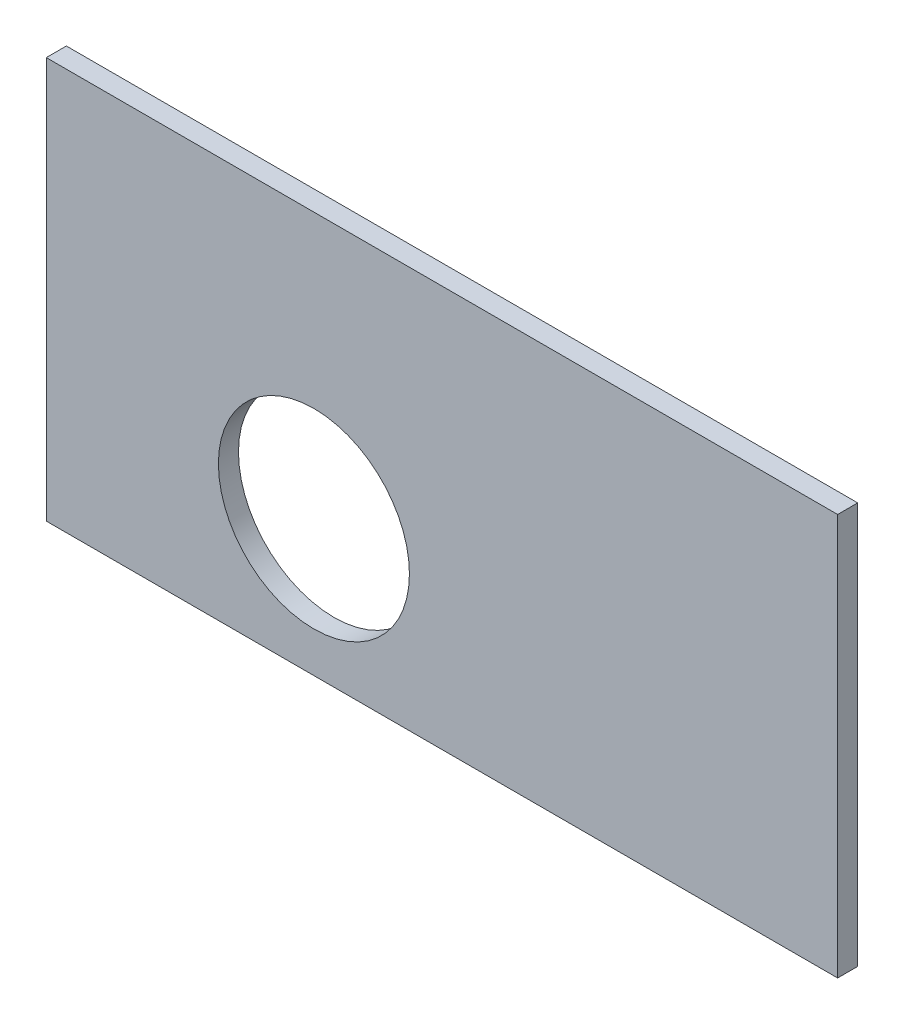
ISO-10303-21;
HEADER;
FILE_DESCRIPTION(('STEP AP214'),'2;1');
FILE_NAME('part.step','',(''),(''),'','','');
FILE_SCHEMA(('AUTOMOTIVE_DESIGN { 1 0 10303 214 1 1 1 1 }'));
ENDSEC;
DATA;
#1=APPLICATION_CONTEXT('core data for automotive mechanical design processes');
#2=APPLICATION_PROTOCOL_DEFINITION('international standard','automotive_design',2000,#1);
#3=PRODUCT_CONTEXT('',#1,'mechanical');
#4=PRODUCT('Part','Part','',(#3));
#5=PRODUCT_RELATED_PRODUCT_CATEGORY('part','',(#4));
#6=PRODUCT_DEFINITION_FORMATION('','',#4);
#7=PRODUCT_DEFINITION_CONTEXT('part definition',#1,'design');
#8=PRODUCT_DEFINITION('design','',#6,#7);
#9=PRODUCT_DEFINITION_SHAPE('','',#8);
#10=(LENGTH_UNIT() NAMED_UNIT(*) SI_UNIT(.MILLI.,.METRE.));
#11=(NAMED_UNIT(*) PLANE_ANGLE_UNIT() SI_UNIT($,.RADIAN.));
#12=(NAMED_UNIT(*) SI_UNIT($,.STERADIAN.) SOLID_ANGLE_UNIT());
#13=UNCERTAINTY_MEASURE_WITH_UNIT(LENGTH_MEASURE(1.E-05),#10,'distance_accuracy_value','');
#14=(GEOMETRIC_REPRESENTATION_CONTEXT(3) GLOBAL_UNCERTAINTY_ASSIGNED_CONTEXT((#13)) GLOBAL_UNIT_ASSIGNED_CONTEXT((#10,
#11,#12)) REPRESENTATION_CONTEXT('',''));
#15=CARTESIAN_POINT('',(0.,0.,0.));
#16=DIRECTION('',(0.,0.,1.));
#17=DIRECTION('',(1.,0.,0.));
#18=AXIS2_PLACEMENT_3D('',#15,#16,#17);
#19=CARTESIAN_POINT('',(0.,0.,3.));
#20=DIRECTION('',(1.,0.,0.));
#21=DIRECTION('',(0.,0.,-1.));
#22=AXIS2_PLACEMENT_3D('',#19,#20,#21);
#23=PLANE('',#22);
#24=DIRECTION('',(0.,-1.,0.));
#25=VECTOR('',#24,1.);
#26=CARTESIAN_POINT('',(0.,0.,0.));
#27=LINE('',#26,#25);
#28=CARTESIAN_POINT('',(0.,60.,0.));
#29=VERTEX_POINT('',#28);
#30=CARTESIAN_POINT('',(0.,0.,0.));
#31=VERTEX_POINT('',#30);
#32=EDGE_CURVE('E114',#29,#31,#27,.T.);
#33=ORIENTED_EDGE('',*,*,#32,.T.);
#34=DIRECTION('',(0.,0.,-1.));
#35=VECTOR('',#34,1.);
#36=CARTESIAN_POINT('',(0.,0.,3.));
#37=LINE('',#36,#35);
#38=CARTESIAN_POINT('',(0.,0.,3.));
#39=VERTEX_POINT('',#38);
#40=EDGE_CURVE('E11',#39,#31,#37,.T.);
#41=ORIENTED_EDGE('',*,*,#40,.F.);
#42=DIRECTION('',(0.,-1.,0.));
#43=VECTOR('',#42,1.);
#44=CARTESIAN_POINT('',(0.,0.,3.));
#45=LINE('',#44,#43);
#46=CARTESIAN_POINT('',(0.,60.,3.));
#47=VERTEX_POINT('',#46);
#48=EDGE_CURVE('E100',#47,#39,#45,.T.);
#49=ORIENTED_EDGE('',*,*,#48,.F.);
#50=DIRECTION('',(0.,0.,-1.));
#51=VECTOR('',#50,1.);
#52=CARTESIAN_POINT('',(0.,60.,3.));
#53=LINE('',#52,#51);
#54=EDGE_CURVE('E108',#47,#29,#53,.T.);
#55=ORIENTED_EDGE('',*,*,#54,.T.);
#56=EDGE_LOOP('',(#33,#41,#49,#55));
#57=FACE_BOUND('',#56,.T.);
#58=ADVANCED_FACE('F44',(#57),#23,.F.);
#59=CARTESIAN_POINT('',(0.,0.,3.));
#60=DIRECTION('',(0.,1.,0.));
#61=DIRECTION('',(0.,0.,1.));
#62=AXIS2_PLACEMENT_3D('',#59,#60,#61);
#63=PLANE('',#62);
#64=DIRECTION('',(1.,0.,0.));
#65=VECTOR('',#64,1.);
#66=CARTESIAN_POINT('',(0.,0.,0.));
#67=LINE('',#66,#65);
#68=CARTESIAN_POINT('',(118.28,0.,0.));
#69=VERTEX_POINT('',#68);
#70=EDGE_CURVE('E105',#31,#69,#67,.T.);
#71=ORIENTED_EDGE('',*,*,#70,.T.);
#72=DIRECTION('',(0.,0.,-1.));
#73=VECTOR('',#72,1.);
#74=CARTESIAN_POINT('',(118.28,0.,3.));
#75=LINE('',#74,#73);
#76=CARTESIAN_POINT('',(118.28,0.,3.));
#77=VERTEX_POINT('',#76);
#78=EDGE_CURVE('E53',#77,#69,#75,.T.);
#79=ORIENTED_EDGE('',*,*,#78,.F.);
#80=DIRECTION('',(1.,0.,0.));
#81=VECTOR('',#80,1.);
#82=CARTESIAN_POINT('',(0.,0.,3.));
#83=LINE('',#82,#81);
#84=EDGE_CURVE('E95',#39,#77,#83,.T.);
#85=ORIENTED_EDGE('',*,*,#84,.F.);
#86=ORIENTED_EDGE('',*,*,#40,.T.);
#87=EDGE_LOOP('',(#71,#79,#85,#86));
#88=FACE_BOUND('',#87,.T.);
#89=ADVANCED_FACE('F101',(#88),#63,.F.);
#90=CARTESIAN_POINT('',(118.28,0.,3.));
#91=DIRECTION('',(-1.,0.,0.));
#92=DIRECTION('',(0.,0.,1.));
#93=AXIS2_PLACEMENT_3D('',#90,#91,#92);
#94=PLANE('',#93);
#95=DIRECTION('',(0.,1.,0.));
#96=VECTOR('',#95,1.);
#97=CARTESIAN_POINT('',(118.28,0.,0.));
#98=LINE('',#97,#96);
#99=CARTESIAN_POINT('',(118.28,60.,0.));
#100=VERTEX_POINT('',#99);
#101=EDGE_CURVE('E79',#69,#100,#98,.T.);
#102=ORIENTED_EDGE('',*,*,#101,.T.);
#103=DIRECTION('',(0.,0.,-1.));
#104=VECTOR('',#103,1.);
#105=CARTESIAN_POINT('',(118.28,60.,3.));
#106=LINE('',#105,#104);
#107=CARTESIAN_POINT('',(118.28,60.,3.));
#108=VERTEX_POINT('',#107);
#109=EDGE_CURVE('E102',#108,#100,#106,.T.);
#110=ORIENTED_EDGE('',*,*,#109,.F.);
#111=DIRECTION('',(0.,1.,0.));
#112=VECTOR('',#111,1.);
#113=CARTESIAN_POINT('',(118.28,0.,3.));
#114=LINE('',#113,#112);
#115=EDGE_CURVE('E92',#77,#108,#114,.T.);
#116=ORIENTED_EDGE('',*,*,#115,.F.);
#117=ORIENTED_EDGE('',*,*,#78,.T.);
#118=EDGE_LOOP('',(#102,#110,#116,#117));
#119=FACE_BOUND('',#118,.T.);
#120=ADVANCED_FACE('F104',(#119),#94,.F.);
#121=CARTESIAN_POINT('',(0.,60.,3.));
#122=DIRECTION('',(0.,-1.,0.));
#123=DIRECTION('',(0.,0.,-1.));
#124=AXIS2_PLACEMENT_3D('',#121,#122,#123);
#125=PLANE('',#124);
#126=DIRECTION('',(-1.,0.,0.));
#127=VECTOR('',#126,1.);
#128=CARTESIAN_POINT('',(0.,60.,0.));
#129=LINE('',#128,#127);
#130=EDGE_CURVE('E84',#100,#29,#129,.T.);
#131=ORIENTED_EDGE('',*,*,#130,.T.);
#132=ORIENTED_EDGE('',*,*,#54,.F.);
#133=DIRECTION('',(-1.,0.,0.));
#134=VECTOR('',#133,1.);
#135=CARTESIAN_POINT('',(0.,60.,3.));
#136=LINE('',#135,#134);
#137=EDGE_CURVE('E65',#108,#47,#136,.T.);
#138=ORIENTED_EDGE('',*,*,#137,.F.);
#139=ORIENTED_EDGE('',*,*,#109,.T.);
#140=EDGE_LOOP('',(#131,#132,#138,#139));
#141=FACE_BOUND('',#140,.T.);
#142=ADVANCED_FACE('F130',(#141),#125,.F.);
#143=CARTESIAN_POINT('',(0.,0.,3.));
#144=DIRECTION('',(0.,0.,-1.));
#145=DIRECTION('',(-1.,0.,0.));
#146=AXIS2_PLACEMENT_3D('',#143,#144,#145);
#147=PLANE('',#146);
#148=CARTESIAN_POINT('',(40.,20.31,3.));
#149=DIRECTION('',(0.,0.,1.));
#150=DIRECTION('',(1.,0.,0.));
#151=AXIS2_PLACEMENT_3D('',#148,#149,#150);
#152=CIRCLE('',#151,14.275);
#153=CARTESIAN_POINT('',(54.275,20.31,3.));
#154=VERTEX_POINT('',#153);
#155=EDGE_CURVE('E134',#154,#154,#152,.T.);
#156=ORIENTED_EDGE('',*,*,#155,.F.);
#157=EDGE_LOOP('',(#156));
#158=FACE_BOUND('',#157,.T.);
#159=ORIENTED_EDGE('',*,*,#48,.T.);
#160=ORIENTED_EDGE('',*,*,#84,.T.);
#161=ORIENTED_EDGE('',*,*,#115,.T.);
#162=ORIENTED_EDGE('',*,*,#137,.T.);
#163=EDGE_LOOP('',(#159,#160,#161,#162));
#164=FACE_BOUND('',#163,.T.);
#165=ADVANCED_FACE('F91',(#158,#164),#147,.F.);
#166=CARTESIAN_POINT('',(0.,0.,0.));
#167=DIRECTION('',(0.,0.,-1.));
#168=DIRECTION('',(-1.,0.,0.));
#169=AXIS2_PLACEMENT_3D('',#166,#167,#168);
#170=PLANE('',#169);
#171=CARTESIAN_POINT('',(40.,20.31,0.));
#172=DIRECTION('',(0.,0.,1.));
#173=DIRECTION('',(1.,0.,0.));
#174=AXIS2_PLACEMENT_3D('',#171,#172,#173);
#175=CIRCLE('',#174,14.275);
#176=CARTESIAN_POINT('',(54.275,20.31,0.));
#177=VERTEX_POINT('',#176);
#178=EDGE_CURVE('E120',#177,#177,#175,.T.);
#179=ORIENTED_EDGE('',*,*,#178,.T.);
#180=EDGE_LOOP('',(#179));
#181=FACE_BOUND('',#180,.T.);
#182=ORIENTED_EDGE('',*,*,#32,.F.);
#183=ORIENTED_EDGE('',*,*,#130,.F.);
#184=ORIENTED_EDGE('',*,*,#101,.F.);
#185=ORIENTED_EDGE('',*,*,#70,.F.);
#186=EDGE_LOOP('',(#182,#183,#184,#185));
#187=FACE_BOUND('',#186,.T.);
#188=ADVANCED_FACE('F128',(#181,#187),#170,.T.);
#189=CARTESIAN_POINT('',(40.,20.31,0.));
#190=DIRECTION('',(0.,0.,1.));
#191=DIRECTION('',(1.,0.,0.));
#192=AXIS2_PLACEMENT_3D('',#189,#190,#191);
#193=CYLINDRICAL_SURFACE('',#192,14.275);
#194=ORIENTED_EDGE('',*,*,#178,.F.);
#195=EDGE_LOOP('',(#194));
#196=FACE_BOUND('',#195,.T.);
#197=ORIENTED_EDGE('',*,*,#155,.T.);
#198=EDGE_LOOP('',(#197));
#199=FACE_BOUND('',#198,.T.);
#200=ADVANCED_FACE('F141',(#196,#199),#193,.F.);
#201=CLOSED_SHELL('',(#58,#89,#120,#142,#165,#188,#200));
#202=MANIFOLD_SOLID_BREP('B2',#201);
#203=ADVANCED_BREP_SHAPE_REPRESENTATION('',(#18,#202),#14);
#204=SHAPE_DEFINITION_REPRESENTATION(#9,#203);
ENDSEC;
END-ISO-10303-21;
